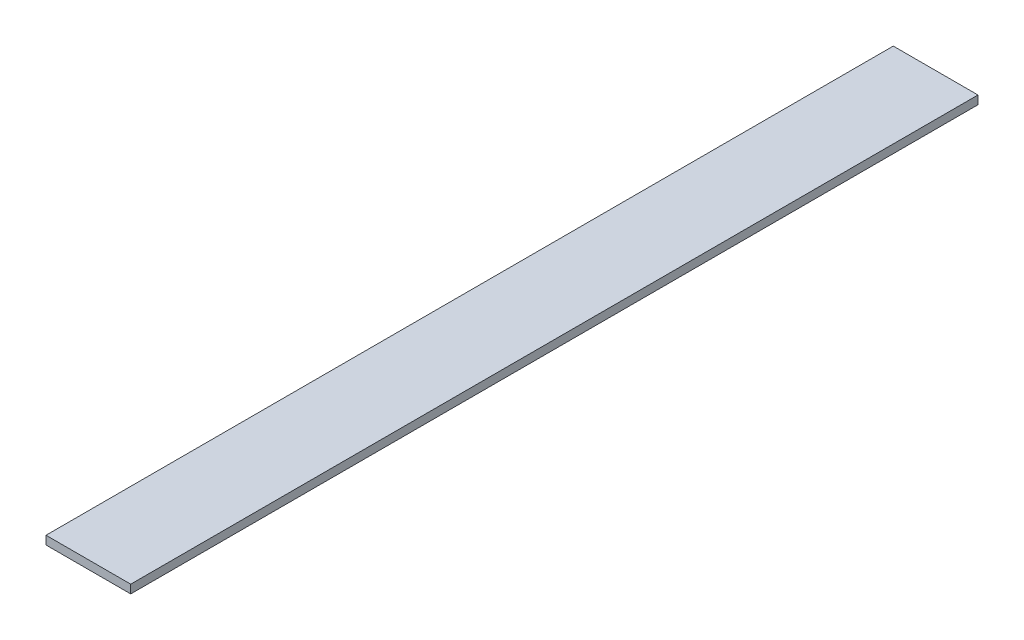
ISO-10303-21;
HEADER;
FILE_DESCRIPTION(('STEP AP214'),'2;1');
FILE_NAME('part.step','',(''),(''),'','','');
FILE_SCHEMA(('AUTOMOTIVE_DESIGN { 1 0 10303 214 1 1 1 1 }'));
ENDSEC;
DATA;
#1=APPLICATION_CONTEXT('core data for automotive mechanical design processes');
#2=APPLICATION_PROTOCOL_DEFINITION('international standard','automotive_design',2000,#1);
#3=PRODUCT_CONTEXT('',#1,'mechanical');
#4=PRODUCT('Part','Part','',(#3));
#5=PRODUCT_RELATED_PRODUCT_CATEGORY('part','',(#4));
#6=PRODUCT_DEFINITION_FORMATION('','',#4);
#7=PRODUCT_DEFINITION_CONTEXT('part definition',#1,'design');
#8=PRODUCT_DEFINITION('design','',#6,#7);
#9=PRODUCT_DEFINITION_SHAPE('','',#8);
#10=(LENGTH_UNIT() NAMED_UNIT(*) SI_UNIT(.MILLI.,.METRE.));
#11=(NAMED_UNIT(*) PLANE_ANGLE_UNIT() SI_UNIT($,.RADIAN.));
#12=(NAMED_UNIT(*) SI_UNIT($,.STERADIAN.) SOLID_ANGLE_UNIT());
#13=UNCERTAINTY_MEASURE_WITH_UNIT(LENGTH_MEASURE(1.E-05),#10,'distance_accuracy_value','');
#14=(GEOMETRIC_REPRESENTATION_CONTEXT(3) GLOBAL_UNCERTAINTY_ASSIGNED_CONTEXT((#13)) GLOBAL_UNIT_ASSIGNED_CONTEXT((#10,
#11,#12)) REPRESENTATION_CONTEXT('',''));
#15=CARTESIAN_POINT('',(0.,0.,0.));
#16=DIRECTION('',(0.,0.,1.));
#17=DIRECTION('',(1.,0.,0.));
#18=AXIS2_PLACEMENT_3D('',#15,#16,#17);
#19=CARTESIAN_POINT('',(0.,0.,635.));
#20=DIRECTION('',(1.,0.,0.));
#21=DIRECTION('',(0.,0.,-1.));
#22=AXIS2_PLACEMENT_3D('',#19,#20,#21);
#23=PLANE('',#22);
#24=DIRECTION('',(0.,-1.,0.));
#25=VECTOR('',#24,1.);
#26=CARTESIAN_POINT('',(0.,0.,0.));
#27=LINE('',#26,#25);
#28=CARTESIAN_POINT('',(0.,6.35,0.));
#29=VERTEX_POINT('',#28);
#30=CARTESIAN_POINT('',(0.,0.,0.));
#31=VERTEX_POINT('',#30);
#32=EDGE_CURVE('E98',#29,#31,#27,.T.);
#33=ORIENTED_EDGE('',*,*,#32,.T.);
#34=DIRECTION('',(0.,0.,-1.));
#35=VECTOR('',#34,1.);
#36=CARTESIAN_POINT('',(0.,0.,635.));
#37=LINE('',#36,#35);
#38=CARTESIAN_POINT('',(0.,0.,635.));
#39=VERTEX_POINT('',#38);
#40=EDGE_CURVE('E11',#39,#31,#37,.T.);
#41=ORIENTED_EDGE('',*,*,#40,.F.);
#42=DIRECTION('',(0.,-1.,0.));
#43=VECTOR('',#42,1.);
#44=CARTESIAN_POINT('',(0.,0.,635.));
#45=LINE('',#44,#43);
#46=CARTESIAN_POINT('',(0.,6.35,635.));
#47=VERTEX_POINT('',#46);
#48=EDGE_CURVE('E86',#47,#39,#45,.T.);
#49=ORIENTED_EDGE('',*,*,#48,.F.);
#50=DIRECTION('',(0.,0.,-1.));
#51=VECTOR('',#50,1.);
#52=CARTESIAN_POINT('',(0.,6.35,635.));
#53=LINE('',#52,#51);
#54=EDGE_CURVE('E94',#47,#29,#53,.T.);
#55=ORIENTED_EDGE('',*,*,#54,.T.);
#56=EDGE_LOOP('',(#33,#41,#49,#55));
#57=FACE_BOUND('',#56,.T.);
#58=ADVANCED_FACE('F35',(#57),#23,.F.);
#59=CARTESIAN_POINT('',(0.,0.,635.));
#60=DIRECTION('',(0.,1.,0.));
#61=DIRECTION('',(0.,0.,1.));
#62=AXIS2_PLACEMENT_3D('',#59,#60,#61);
#63=PLANE('',#62);
#64=DIRECTION('',(1.,0.,0.));
#65=VECTOR('',#64,1.);
#66=CARTESIAN_POINT('',(0.,0.,0.));
#67=LINE('',#66,#65);
#68=CARTESIAN_POINT('',(63.5,0.,0.));
#69=VERTEX_POINT('',#68);
#70=EDGE_CURVE('E90',#31,#69,#67,.T.);
#71=ORIENTED_EDGE('',*,*,#70,.T.);
#72=DIRECTION('',(0.,0.,-1.));
#73=VECTOR('',#72,1.);
#74=CARTESIAN_POINT('',(63.5,0.,635.));
#75=LINE('',#74,#73);
#76=CARTESIAN_POINT('',(63.5,0.,635.));
#77=VERTEX_POINT('',#76);
#78=EDGE_CURVE('E43',#77,#69,#75,.T.);
#79=ORIENTED_EDGE('',*,*,#78,.F.);
#80=DIRECTION('',(1.,0.,0.));
#81=VECTOR('',#80,1.);
#82=CARTESIAN_POINT('',(0.,0.,635.));
#83=LINE('',#82,#81);
#84=EDGE_CURVE('E81',#39,#77,#83,.T.);
#85=ORIENTED_EDGE('',*,*,#84,.F.);
#86=ORIENTED_EDGE('',*,*,#40,.T.);
#87=EDGE_LOOP('',(#71,#79,#85,#86));
#88=FACE_BOUND('',#87,.T.);
#89=ADVANCED_FACE('F89',(#88),#63,.F.);
#90=CARTESIAN_POINT('',(63.5,0.,635.));
#91=DIRECTION('',(-1.,0.,0.));
#92=DIRECTION('',(0.,0.,1.));
#93=AXIS2_PLACEMENT_3D('',#90,#91,#92);
#94=PLANE('',#93);
#95=DIRECTION('',(0.,1.,0.));
#96=VECTOR('',#95,1.);
#97=CARTESIAN_POINT('',(63.5,0.,0.));
#98=LINE('',#97,#96);
#99=CARTESIAN_POINT('',(63.5,6.35,0.));
#100=VERTEX_POINT('',#99);
#101=EDGE_CURVE('E68',#69,#100,#98,.T.);
#102=ORIENTED_EDGE('',*,*,#101,.T.);
#103=DIRECTION('',(0.,0.,-1.));
#104=VECTOR('',#103,1.);
#105=CARTESIAN_POINT('',(63.5,6.35,635.));
#106=LINE('',#105,#104);
#107=CARTESIAN_POINT('',(63.5,6.35,635.));
#108=VERTEX_POINT('',#107);
#109=EDGE_CURVE('E91',#108,#100,#106,.T.);
#110=ORIENTED_EDGE('',*,*,#109,.F.);
#111=DIRECTION('',(0.,1.,0.));
#112=VECTOR('',#111,1.);
#113=CARTESIAN_POINT('',(63.5,0.,635.));
#114=LINE('',#113,#112);
#115=EDGE_CURVE('E84',#77,#108,#114,.T.);
#116=ORIENTED_EDGE('',*,*,#115,.F.);
#117=ORIENTED_EDGE('',*,*,#78,.T.);
#118=EDGE_LOOP('',(#102,#110,#116,#117));
#119=FACE_BOUND('',#118,.T.);
#120=ADVANCED_FACE('F92',(#119),#94,.F.);
#121=CARTESIAN_POINT('',(0.,6.35,635.));
#122=DIRECTION('',(0.,-1.,0.));
#123=DIRECTION('',(0.,0.,-1.));
#124=AXIS2_PLACEMENT_3D('',#121,#122,#123);
#125=PLANE('',#124);
#126=DIRECTION('',(-1.,0.,0.));
#127=VECTOR('',#126,1.);
#128=CARTESIAN_POINT('',(0.,6.35,0.));
#129=LINE('',#128,#127);
#130=EDGE_CURVE('E74',#100,#29,#129,.T.);
#131=ORIENTED_EDGE('',*,*,#130,.T.);
#132=ORIENTED_EDGE('',*,*,#54,.F.);
#133=DIRECTION('',(-1.,0.,0.));
#134=VECTOR('',#133,1.);
#135=CARTESIAN_POINT('',(0.,6.35,635.));
#136=LINE('',#135,#134);
#137=EDGE_CURVE('E51',#108,#47,#136,.T.);
#138=ORIENTED_EDGE('',*,*,#137,.F.);
#139=ORIENTED_EDGE('',*,*,#109,.T.);
#140=EDGE_LOOP('',(#131,#132,#138,#139));
#141=FACE_BOUND('',#140,.T.);
#142=ADVANCED_FACE('F105',(#141),#125,.F.);
#143=CARTESIAN_POINT('',(0.,0.,635.));
#144=DIRECTION('',(0.,0.,-1.));
#145=DIRECTION('',(-1.,0.,0.));
#146=AXIS2_PLACEMENT_3D('',#143,#144,#145);
#147=PLANE('',#146);
#148=ORIENTED_EDGE('',*,*,#48,.T.);
#149=ORIENTED_EDGE('',*,*,#84,.T.);
#150=ORIENTED_EDGE('',*,*,#115,.T.);
#151=ORIENTED_EDGE('',*,*,#137,.T.);
#152=EDGE_LOOP('',(#148,#149,#150,#151));
#153=FACE_BOUND('',#152,.T.);
#154=ADVANCED_FACE('F82',(#153),#147,.F.);
#155=CARTESIAN_POINT('',(0.,0.,0.));
#156=DIRECTION('',(0.,0.,-1.));
#157=DIRECTION('',(-1.,0.,0.));
#158=AXIS2_PLACEMENT_3D('',#155,#156,#157);
#159=PLANE('',#158);
#160=ORIENTED_EDGE('',*,*,#32,.F.);
#161=ORIENTED_EDGE('',*,*,#130,.F.);
#162=ORIENTED_EDGE('',*,*,#101,.F.);
#163=ORIENTED_EDGE('',*,*,#70,.F.);
#164=EDGE_LOOP('',(#160,#161,#162,#163));
#165=FACE_BOUND('',#164,.T.);
#166=ADVANCED_FACE('F108',(#165),#159,.T.);
#167=CLOSED_SHELL('',(#58,#89,#120,#142,#154,#166));
#168=MANIFOLD_SOLID_BREP('B2',#167);
#169=ADVANCED_BREP_SHAPE_REPRESENTATION('',(#18,#168),#14);
#170=SHAPE_DEFINITION_REPRESENTATION(#9,#169);
ENDSEC;
END-ISO-10303-21;
